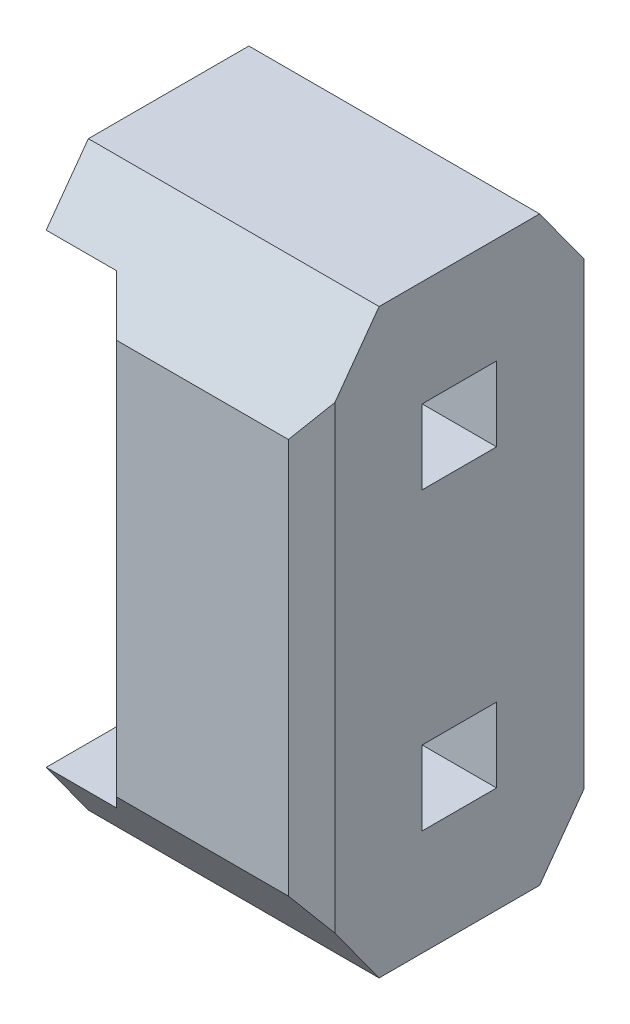
ISO-10303-21;
HEADER;
FILE_DESCRIPTION(('STEP AP214'),'2;1');
FILE_NAME('part.step','',(''),(''),'','','');
FILE_SCHEMA(('AUTOMOTIVE_DESIGN { 1 0 10303 214 1 1 1 1 }'));
ENDSEC;
DATA;
#1=APPLICATION_CONTEXT('core data for automotive mechanical design processes');
#2=APPLICATION_PROTOCOL_DEFINITION('international standard','automotive_design',2000,#1);
#3=PRODUCT_CONTEXT('',#1,'mechanical');
#4=PRODUCT('Part','Part','',(#3));
#5=PRODUCT_RELATED_PRODUCT_CATEGORY('part','',(#4));
#6=PRODUCT_DEFINITION_FORMATION('','',#4);
#7=PRODUCT_DEFINITION_CONTEXT('part definition',#1,'design');
#8=PRODUCT_DEFINITION('design','',#6,#7);
#9=PRODUCT_DEFINITION_SHAPE('','',#8);
#10=(LENGTH_UNIT() NAMED_UNIT(*) SI_UNIT(.MILLI.,.METRE.));
#11=(NAMED_UNIT(*) PLANE_ANGLE_UNIT() SI_UNIT($,.RADIAN.));
#12=(NAMED_UNIT(*) SI_UNIT($,.STERADIAN.) SOLID_ANGLE_UNIT());
#13=UNCERTAINTY_MEASURE_WITH_UNIT(LENGTH_MEASURE(1.E-05),#10,'distance_accuracy_value','');
#14=(GEOMETRIC_REPRESENTATION_CONTEXT(3) GLOBAL_UNCERTAINTY_ASSIGNED_CONTEXT((#13)) GLOBAL_UNIT_ASSIGNED_CONTEXT((#10,
#11,#12)) REPRESENTATION_CONTEXT('',''));
#15=CARTESIAN_POINT('',(0.,0.,0.));
#16=DIRECTION('',(0.,0.,1.));
#17=DIRECTION('',(1.,0.,0.));
#18=AXIS2_PLACEMENT_3D('',#15,#16,#17);
#19=CARTESIAN_POINT('',(1.25,4.6,-38.39));
#20=DIRECTION('',(0.,0.586967571460905,0.809610443394407));
#21=DIRECTION('',(0.,-0.809610443394407,0.586967571460905));
#22=AXIS2_PLACEMENT_3D('',#19,#20,#21);
#23=PLANE('',#22);
#24=DIRECTION('',(1.,0.,0.));
#25=VECTOR('',#24,1.);
#26=CARTESIAN_POINT('',(1.25,4.5,-38.3175));
#27=LINE('',#26,#25);
#28=CARTESIAN_POINT('',(0.,4.5,-38.3175));
#29=VERTEX_POINT('',#28);
#30=CARTESIAN_POINT('',(0.602500000000325,4.5,-38.3175000000001));
#31=VERTEX_POINT('',#30);
#32=EDGE_CURVE('E199',#29,#31,#27,.T.);
#33=ORIENTED_EDGE('',*,*,#32,.T.);
#34=DIRECTION('',(0.506207656348697,-0.698217457033984,0.506207656349602));
#35=VECTOR('',#34,1.);
#36=CARTESIAN_POINT('',(0.6025000000002,4.5,-38.3175));
#37=LINE('',#36,#35);
#38=CARTESIAN_POINT('',(0.819999999999671,4.2,-38.0999999999999));
#39=VERTEX_POINT('',#38);
#40=EDGE_CURVE('E197',#31,#39,#37,.T.);
#41=ORIENTED_EDGE('',*,*,#40,.T.);
#42=DIRECTION('',(1.,0.,0.));
#43=VECTOR('',#42,1.);
#44=CARTESIAN_POINT('',(1.25,4.19999999999999,-38.1));
#45=LINE('',#44,#43);
#46=CARTESIAN_POINT('',(2.30000000000012,4.2,-38.0999999999999));
#47=VERTEX_POINT('',#46);
#48=EDGE_CURVE('E20',#39,#47,#45,.T.);
#49=ORIENTED_EDGE('',*,*,#48,.T.);
#50=DIRECTION('',(0.506207656348957,0.698217457033858,-0.506207656349515));
#51=VECTOR('',#50,1.);
#52=CARTESIAN_POINT('',(2.3,4.19999999999999,-38.1));
#53=LINE('',#52,#51);
#54=CARTESIAN_POINT('',(2.49999999999988,4.47586206896592,-38.3000000000002));
#55=VERTEX_POINT('',#54);
#56=EDGE_CURVE('E181',#47,#55,#53,.T.);
#57=ORIENTED_EDGE('',*,*,#56,.T.);
#58=DIRECTION('',(0.,-0.809610443394407,0.586967571460905));
#59=VECTOR('',#58,1.);
#60=CARTESIAN_POINT('',(2.5,4.6,-38.39));
#61=LINE('',#60,#59);
#62=CARTESIAN_POINT('',(2.5,5.,-38.68));
#63=VERTEX_POINT('',#62);
#64=EDGE_CURVE('E188',#55,#63,#61,.F.);
#65=ORIENTED_EDGE('',*,*,#64,.T.);
#66=DIRECTION('',(1.,0.,0.));
#67=VECTOR('',#66,1.);
#68=CARTESIAN_POINT('',(1.25,5.,-38.68));
#69=LINE('',#68,#67);
#70=CARTESIAN_POINT('',(0.,5.,-38.68));
#71=VERTEX_POINT('',#70);
#72=EDGE_CURVE('E215',#71,#63,#69,.T.);
#73=ORIENTED_EDGE('',*,*,#72,.F.);
#74=DIRECTION('',(0.,-0.809610443394407,0.586967571460905));
#75=VECTOR('',#74,1.);
#76=CARTESIAN_POINT('',(0.,4.6,-38.39));
#77=LINE('',#76,#75);
#78=EDGE_CURVE('E207',#71,#29,#77,.T.);
#79=ORIENTED_EDGE('',*,*,#78,.T.);
#80=EDGE_LOOP('',(#33,#41,#49,#57,#65,#73,#79));
#81=FACE_BOUND('',#80,.T.);
#82=ADVANCED_FACE('F17',(#81),#23,.T.);
#83=CARTESIAN_POINT('',(1.25,4.6,-40.35));
#84=DIRECTION('',(0.,-0.586967571460905,0.809610443394407));
#85=DIRECTION('',(0.,-0.809610443394407,-0.586967571460905));
#86=AXIS2_PLACEMENT_3D('',#83,#84,#85);
#87=PLANE('',#86);
#88=DIRECTION('',(0.,-0.809610443394407,-0.586967571460905));
#89=VECTOR('',#88,1.);
#90=CARTESIAN_POINT('',(0.,4.6,-40.35));
#91=LINE('',#90,#89);
#92=CARTESIAN_POINT('',(0.,5.,-40.06));
#93=VERTEX_POINT('',#92);
#94=CARTESIAN_POINT('',(0.,4.5,-40.4225));
#95=VERTEX_POINT('',#94);
#96=EDGE_CURVE('E263',#93,#95,#91,.T.);
#97=ORIENTED_EDGE('',*,*,#96,.F.);
#98=DIRECTION('',(1.,0.,0.));
#99=VECTOR('',#98,1.);
#100=CARTESIAN_POINT('',(1.25,5.,-40.06));
#101=LINE('',#100,#99);
#102=CARTESIAN_POINT('',(2.5,5.,-40.06));
#103=VERTEX_POINT('',#102);
#104=EDGE_CURVE('E227',#103,#93,#101,.F.);
#105=ORIENTED_EDGE('',*,*,#104,.F.);
#106=DIRECTION('',(0.,-0.809610443394407,-0.586967571460905));
#107=VECTOR('',#106,1.);
#108=CARTESIAN_POINT('',(2.5,4.6,-40.35));
#109=LINE('',#108,#107);
#110=CARTESIAN_POINT('',(2.49999999999988,4.47586206896592,-40.4399999999998));
#111=VERTEX_POINT('',#110);
#112=EDGE_CURVE('E223',#111,#103,#109,.F.);
#113=ORIENTED_EDGE('',*,*,#112,.F.);
#114=DIRECTION('',(0.506207656348954,0.698217457033861,0.506207656349513));
#115=VECTOR('',#114,1.);
#116=CARTESIAN_POINT('',(2.3,4.19999999999999,-40.64));
#117=LINE('',#116,#115);
#118=CARTESIAN_POINT('',(2.30000000000012,4.2,-40.6400000000001));
#119=VERTEX_POINT('',#118);
#120=EDGE_CURVE('E266',#119,#111,#117,.T.);
#121=ORIENTED_EDGE('',*,*,#120,.F.);
#122=DIRECTION('',(1.,0.,0.));
#123=VECTOR('',#122,1.);
#124=CARTESIAN_POINT('',(1.25,4.19999999999999,-40.64));
#125=LINE('',#124,#123);
#126=CARTESIAN_POINT('',(0.819999999999671,4.2,-40.6400000000001));
#127=VERTEX_POINT('',#126);
#128=EDGE_CURVE('E205',#127,#119,#125,.T.);
#129=ORIENTED_EDGE('',*,*,#128,.F.);
#130=DIRECTION('',(0.506207656348697,-0.698217457033984,-0.506207656349602));
#131=VECTOR('',#130,1.);
#132=CARTESIAN_POINT('',(0.6025000000002,4.5,-40.4225));
#133=LINE('',#132,#131);
#134=CARTESIAN_POINT('',(0.602500000000324,4.5,-40.4224999999999));
#135=VERTEX_POINT('',#134);
#136=EDGE_CURVE('E203',#135,#127,#133,.T.);
#137=ORIENTED_EDGE('',*,*,#136,.F.);
#138=DIRECTION('',(1.,0.,0.));
#139=VECTOR('',#138,1.);
#140=CARTESIAN_POINT('',(1.25,4.5,-40.4225));
#141=LINE('',#140,#139);
#142=EDGE_CURVE('E261',#95,#135,#141,.T.);
#143=ORIENTED_EDGE('',*,*,#142,.F.);
#144=EDGE_LOOP('',(#97,#105,#113,#121,#129,#137,#143));
#145=FACE_BOUND('',#144,.T.);
#146=ADVANCED_FACE('F285',(#145),#87,.F.);
#147=CARTESIAN_POINT('',(1.25,0.4,-40.35));
#148=DIRECTION('',(0.,0.586967571460905,0.809610443394407));
#149=DIRECTION('',(0.,-0.809610443394407,0.586967571460905));
#150=AXIS2_PLACEMENT_3D('',#147,#148,#149);
#151=PLANE('',#150);
#152=DIRECTION('',(-0.5062076563494,0.698217457033649,-0.506207656349361));
#153=VECTOR('',#152,1.);
#154=CARTESIAN_POINT('',(2.5,0.524137931034493,-40.44));
#155=LINE('',#154,#153);
#156=CARTESIAN_POINT('',(2.49999999999988,0.524137931034496,-40.4399999999999));
#157=VERTEX_POINT('',#156);
#158=CARTESIAN_POINT('',(2.30000000000012,0.800000000000004,-40.6400000000001));
#159=VERTEX_POINT('',#158);
#160=EDGE_CURVE('E251',#157,#159,#155,.T.);
#161=ORIENTED_EDGE('',*,*,#160,.F.);
#162=DIRECTION('',(0.,-0.809610443394407,0.586967571460905));
#163=VECTOR('',#162,1.);
#164=CARTESIAN_POINT('',(2.5,0.4,-40.35));
#165=LINE('',#164,#163);
#166=CARTESIAN_POINT('',(2.5,0.,-40.06));
#167=VERTEX_POINT('',#166);
#168=EDGE_CURVE('E253',#167,#157,#165,.F.);
#169=ORIENTED_EDGE('',*,*,#168,.F.);
#170=DIRECTION('',(1.,0.,0.));
#171=VECTOR('',#170,1.);
#172=CARTESIAN_POINT('',(1.25,0.,-40.06));
#173=LINE('',#172,#171);
#174=CARTESIAN_POINT('',(0.,0.,-40.06));
#175=VERTEX_POINT('',#174);
#176=EDGE_CURVE('E288',#167,#175,#173,.F.);
#177=ORIENTED_EDGE('',*,*,#176,.T.);
#178=DIRECTION('',(0.,-0.809610443394407,0.586967571460905));
#179=VECTOR('',#178,1.);
#180=CARTESIAN_POINT('',(0.,0.4,-40.35));
#181=LINE('',#180,#179);
#182=CARTESIAN_POINT('',(0.,0.5,-40.4225));
#183=VERTEX_POINT('',#182);
#184=EDGE_CURVE('E255',#183,#175,#181,.T.);
#185=ORIENTED_EDGE('',*,*,#184,.F.);
#186=DIRECTION('',(1.,0.,0.));
#187=VECTOR('',#186,1.);
#188=CARTESIAN_POINT('',(1.25,0.500000000000001,-40.4225));
#189=LINE('',#188,#187);
#190=CARTESIAN_POINT('',(0.602500000000324,0.5,-40.4224999999999));
#191=VERTEX_POINT('',#190);
#192=EDGE_CURVE('E257',#191,#183,#189,.F.);
#193=ORIENTED_EDGE('',*,*,#192,.F.);
#194=DIRECTION('',(-0.506207656348696,-0.698217457033985,0.506207656349601));
#195=VECTOR('',#194,1.);
#196=CARTESIAN_POINT('',(0.8199999999998,0.800000000000008,-40.64));
#197=LINE('',#196,#195);
#198=CARTESIAN_POINT('',(0.819999999999671,0.800000000000004,-40.6400000000001));
#199=VERTEX_POINT('',#198);
#200=EDGE_CURVE('E259',#199,#191,#197,.T.);
#201=ORIENTED_EDGE('',*,*,#200,.F.);
#202=DIRECTION('',(1.,0.,0.));
#203=VECTOR('',#202,1.);
#204=CARTESIAN_POINT('',(1.25,0.800000000000008,-40.64));
#205=LINE('',#204,#203);
#206=EDGE_CURVE('E249',#159,#199,#205,.F.);
#207=ORIENTED_EDGE('',*,*,#206,.F.);
#208=EDGE_LOOP('',(#161,#169,#177,#185,#193,#201,#207));
#209=FACE_BOUND('',#208,.T.);
#210=ADVANCED_FACE('F431',(#209),#151,.F.);
#211=CARTESIAN_POINT('',(1.25,0.4,-38.39));
#212=DIRECTION('',(0.,-0.586967571460905,0.809610443394407));
#213=DIRECTION('',(0.,-0.809610443394407,-0.586967571460905));
#214=AXIS2_PLACEMENT_3D('',#211,#212,#213);
#215=PLANE('',#214);
#216=DIRECTION('',(1.,0.,0.));
#217=VECTOR('',#216,1.);
#218=CARTESIAN_POINT('',(1.25,0.800000000000008,-38.1));
#219=LINE('',#218,#217);
#220=CARTESIAN_POINT('',(2.30000000000012,0.800000000000004,-38.0999999999999));
#221=VERTEX_POINT('',#220);
#222=CARTESIAN_POINT('',(0.819999999999671,0.800000000000004,-38.0999999999999));
#223=VERTEX_POINT('',#222);
#224=EDGE_CURVE('E191',#221,#223,#219,.F.);
#225=ORIENTED_EDGE('',*,*,#224,.T.);
#226=DIRECTION('',(-0.506207656348696,-0.698217457033985,-0.506207656349601));
#227=VECTOR('',#226,1.);
#228=CARTESIAN_POINT('',(0.8199999999998,0.800000000000008,-38.1));
#229=LINE('',#228,#227);
#230=CARTESIAN_POINT('',(0.602500000000324,0.5,-38.3175000000001));
#231=VERTEX_POINT('',#230);
#232=EDGE_CURVE('E232',#223,#231,#229,.T.);
#233=ORIENTED_EDGE('',*,*,#232,.T.);
#234=DIRECTION('',(1.,0.,0.));
#235=VECTOR('',#234,1.);
#236=CARTESIAN_POINT('',(1.25,0.500000000000001,-38.3175));
#237=LINE('',#236,#235);
#238=CARTESIAN_POINT('',(0.,0.5,-38.3175));
#239=VERTEX_POINT('',#238);
#240=EDGE_CURVE('E246',#231,#239,#237,.F.);
#241=ORIENTED_EDGE('',*,*,#240,.T.);
#242=DIRECTION('',(0.,-0.809610443394407,-0.586967571460905));
#243=VECTOR('',#242,1.);
#244=CARTESIAN_POINT('',(0.,0.4,-38.39));
#245=LINE('',#244,#243);
#246=CARTESIAN_POINT('',(0.,0.,-38.68));
#247=VERTEX_POINT('',#246);
#248=EDGE_CURVE('E244',#239,#247,#245,.T.);
#249=ORIENTED_EDGE('',*,*,#248,.T.);
#250=DIRECTION('',(1.,0.,0.));
#251=VECTOR('',#250,1.);
#252=CARTESIAN_POINT('',(1.25,0.,-38.68));
#253=LINE('',#252,#251);
#254=CARTESIAN_POINT('',(2.5,0.,-38.68));
#255=VERTEX_POINT('',#254);
#256=EDGE_CURVE('E293',#247,#255,#253,.T.);
#257=ORIENTED_EDGE('',*,*,#256,.T.);
#258=DIRECTION('',(0.,-0.809610443394407,-0.586967571460905));
#259=VECTOR('',#258,1.);
#260=CARTESIAN_POINT('',(2.5,0.4,-38.39));
#261=LINE('',#260,#259);
#262=CARTESIAN_POINT('',(2.49999999999988,0.524137931034499,-38.3000000000001));
#263=VERTEX_POINT('',#262);
#264=EDGE_CURVE('E241',#255,#263,#261,.F.);
#265=ORIENTED_EDGE('',*,*,#264,.T.);
#266=DIRECTION('',(-0.506207656349409,0.698217457033648,0.506207656349353));
#267=VECTOR('',#266,1.);
#268=CARTESIAN_POINT('',(2.5,0.524137931034498,-38.3));
#269=LINE('',#268,#267);
#270=EDGE_CURVE('E239',#263,#221,#269,.T.);
#271=ORIENTED_EDGE('',*,*,#270,.T.);
#272=EDGE_LOOP('',(#225,#233,#241,#249,#257,#265,#271));
#273=FACE_BOUND('',#272,.T.);
#274=ADVANCED_FACE('F421',(#273),#215,.T.);
#275=CARTESIAN_POINT('',(1.25,5.,-39.37));
#276=DIRECTION('',(0.,1.,0.));
#277=DIRECTION('',(0.,0.,1.));
#278=AXIS2_PLACEMENT_3D('',#275,#276,#277);
#279=PLANE('',#278);
#280=ORIENTED_EDGE('',*,*,#104,.T.);
#281=DIRECTION('',(0.,0.,-1.));
#282=VECTOR('',#281,1.);
#283=CARTESIAN_POINT('',(0.,5.,-39.37));
#284=LINE('',#283,#282);
#285=EDGE_CURVE('E231',#93,#71,#284,.F.);
#286=ORIENTED_EDGE('',*,*,#285,.T.);
#287=ORIENTED_EDGE('',*,*,#72,.T.);
#288=DIRECTION('',(0.,0.,1.));
#289=VECTOR('',#288,1.);
#290=CARTESIAN_POINT('',(2.5,5.,-39.37));
#291=LINE('',#290,#289);
#292=EDGE_CURVE('E219',#63,#103,#291,.F.);
#293=ORIENTED_EDGE('',*,*,#292,.T.);
#294=EDGE_LOOP('',(#280,#286,#287,#293));
#295=FACE_BOUND('',#294,.T.);
#296=ADVANCED_FACE('F229',(#295),#279,.T.);
#297=CARTESIAN_POINT('',(1.25,0.,-39.37));
#298=DIRECTION('',(0.,1.,0.));
#299=DIRECTION('',(0.,0.,1.));
#300=AXIS2_PLACEMENT_3D('',#297,#298,#299);
#301=PLANE('',#300);
#302=DIRECTION('',(0.,0.,-1.));
#303=VECTOR('',#302,1.);
#304=CARTESIAN_POINT('',(0.,0.,-39.37));
#305=LINE('',#304,#303);
#306=EDGE_CURVE('E297',#247,#175,#305,.T.);
#307=ORIENTED_EDGE('',*,*,#306,.T.);
#308=ORIENTED_EDGE('',*,*,#176,.F.);
#309=DIRECTION('',(0.,0.,1.));
#310=VECTOR('',#309,1.);
#311=CARTESIAN_POINT('',(2.5,0.,-39.37));
#312=LINE('',#311,#310);
#313=EDGE_CURVE('E287',#255,#167,#312,.F.);
#314=ORIENTED_EDGE('',*,*,#313,.F.);
#315=ORIENTED_EDGE('',*,*,#256,.F.);
#316=EDGE_LOOP('',(#307,#308,#314,#315));
#317=FACE_BOUND('',#316,.T.);
#318=ADVANCED_FACE('F428',(#317),#301,.F.);
#319=CARTESIAN_POINT('',(0.,4.75,-39.37));
#320=DIRECTION('',(1.,0.,0.));
#321=DIRECTION('',(0.,0.,-1.));
#322=AXIS2_PLACEMENT_3D('',#319,#320,#321);
#323=PLANE('',#322);
#324=ORIENTED_EDGE('',*,*,#285,.F.);
#325=ORIENTED_EDGE('',*,*,#96,.T.);
#326=DIRECTION('',(0.,0.,1.));
#327=VECTOR('',#326,1.);
#328=CARTESIAN_POINT('',(0.,4.5,-39.37));
#329=LINE('',#328,#327);
#330=EDGE_CURVE('E307',#95,#29,#329,.T.);
#331=ORIENTED_EDGE('',*,*,#330,.T.);
#332=ORIENTED_EDGE('',*,*,#78,.F.);
#333=EDGE_LOOP('',(#324,#325,#331,#332));
#334=FACE_BOUND('',#333,.T.);
#335=ADVANCED_FACE('F441',(#334),#323,.F.);
#336=CARTESIAN_POINT('',(0.,0.25,-39.37));
#337=DIRECTION('',(1.,0.,0.));
#338=DIRECTION('',(0.,0.,-1.));
#339=AXIS2_PLACEMENT_3D('',#336,#337,#338);
#340=PLANE('',#339);
#341=ORIENTED_EDGE('',*,*,#306,.F.);
#342=ORIENTED_EDGE('',*,*,#248,.F.);
#343=DIRECTION('',(0.,0.,1.));
#344=VECTOR('',#343,1.);
#345=CARTESIAN_POINT('',(0.,0.5,-39.37));
#346=LINE('',#345,#344);
#347=EDGE_CURVE('E315',#183,#239,#346,.T.);
#348=ORIENTED_EDGE('',*,*,#347,.F.);
#349=ORIENTED_EDGE('',*,*,#184,.T.);
#350=EDGE_LOOP('',(#341,#342,#348,#349));
#351=FACE_BOUND('',#350,.T.);
#352=ADVANCED_FACE('F443',(#351),#340,.F.);
#353=CARTESIAN_POINT('',(1.55,3.45,-39.37));
#354=DIRECTION('',(0.,1.,0.));
#355=DIRECTION('',(0.,0.,1.));
#356=AXIS2_PLACEMENT_3D('',#353,#354,#355);
#357=PLANE('',#356);
#358=DIRECTION('',(1.,0.,0.));
#359=VECTOR('',#358,1.);
#360=CARTESIAN_POINT('',(1.55,3.45,-39.69));
#361=LINE('',#360,#359);
#362=CARTESIAN_POINT('',(0.6,3.45,-39.69));
#363=VERTEX_POINT('',#362);
#364=CARTESIAN_POINT('',(2.5,3.45,-39.69));
#365=VERTEX_POINT('',#364);
#366=EDGE_CURVE('E332',#363,#365,#361,.T.);
#367=ORIENTED_EDGE('',*,*,#366,.F.);
#368=DIRECTION('',(0.,0.,1.));
#369=VECTOR('',#368,1.);
#370=CARTESIAN_POINT('',(0.6,3.45,-39.37));
#371=LINE('',#370,#369);
#372=CARTESIAN_POINT('',(0.6,3.45,-39.05));
#373=VERTEX_POINT('',#372);
#374=EDGE_CURVE('E302',#363,#373,#371,.T.);
#375=ORIENTED_EDGE('',*,*,#374,.T.);
#376=DIRECTION('',(1.,0.,0.));
#377=VECTOR('',#376,1.);
#378=CARTESIAN_POINT('',(1.55,3.45,-39.05));
#379=LINE('',#378,#377);
#380=CARTESIAN_POINT('',(2.5,3.45,-39.05));
#381=VERTEX_POINT('',#380);
#382=EDGE_CURVE('E327',#373,#381,#379,.T.);
#383=ORIENTED_EDGE('',*,*,#382,.T.);
#384=DIRECTION('',(0.,0.,1.));
#385=VECTOR('',#384,1.);
#386=CARTESIAN_POINT('',(2.5,3.45,-39.37));
#387=LINE('',#386,#385);
#388=EDGE_CURVE('E300',#381,#365,#387,.F.);
#389=ORIENTED_EDGE('',*,*,#388,.T.);
#390=EDGE_LOOP('',(#367,#375,#383,#389));
#391=FACE_BOUND('',#390,.T.);
#392=ADVANCED_FACE('F398',(#391),#357,.T.);
#393=CARTESIAN_POINT('',(0.71,2.5,-40.53));
#394=DIRECTION('',(0.707106781190498,0.,0.707106781182598));
#395=DIRECTION('',(0.707106781182598,0.,-0.707106781190498));
#396=AXIS2_PLACEMENT_3D('',#393,#394,#395);
#397=PLANE('',#396);
#398=ORIENTED_EDGE('',*,*,#200,.T.);
#399=DIRECTION('',(0.707106781187161,0.,-0.707106781185934));
#400=VECTOR('',#399,1.);
#401=CARTESIAN_POINT('',(0.6000000000002,0.5,-40.42));
#402=LINE('',#401,#400);
#403=CARTESIAN_POINT('',(0.600000000000408,0.5,-40.4199999999997));
#404=VERTEX_POINT('',#403);
#405=EDGE_CURVE('E312',#404,#191,#402,.T.);
#406=ORIENTED_EDGE('',*,*,#405,.F.);
#407=DIRECTION('',(0.,1.,0.));
#408=VECTOR('',#407,1.);
#409=CARTESIAN_POINT('',(0.6,2.5,-40.42));
#410=LINE('',#409,#408);
#411=CARTESIAN_POINT('',(0.600000000000408,4.5,-40.4199999999997));
#412=VERTEX_POINT('',#411);
#413=EDGE_CURVE('E337',#404,#412,#410,.T.);
#414=ORIENTED_EDGE('',*,*,#413,.T.);
#415=DIRECTION('',(0.707106781187161,0.,-0.707106781185934));
#416=VECTOR('',#415,1.);
#417=CARTESIAN_POINT('',(0.6000000000002,4.5,-40.42));
#418=LINE('',#417,#416);
#419=EDGE_CURVE('E304',#412,#135,#418,.T.);
#420=ORIENTED_EDGE('',*,*,#419,.T.);
#421=ORIENTED_EDGE('',*,*,#136,.T.);
#422=DIRECTION('',(0.,1.,0.));
#423=VECTOR('',#422,1.);
#424=CARTESIAN_POINT('',(0.8199999999998,2.5,-40.64));
#425=LINE('',#424,#423);
#426=EDGE_CURVE('E275',#127,#199,#425,.F.);
#427=ORIENTED_EDGE('',*,*,#426,.T.);
#428=EDGE_LOOP('',(#398,#406,#414,#420,#421,#427));
#429=FACE_BOUND('',#428,.T.);
#430=ADVANCED_FACE('F435',(#429),#397,.F.);
#431=CARTESIAN_POINT('',(0.30125,4.5,-39.37));
#432=DIRECTION('',(0.,1.,0.));
#433=DIRECTION('',(0.,0.,1.));
#434=AXIS2_PLACEMENT_3D('',#431,#432,#433);
#435=PLANE('',#434);
#436=ORIENTED_EDGE('',*,*,#142,.T.);
#437=ORIENTED_EDGE('',*,*,#419,.F.);
#438=DIRECTION('',(0.,0.,-1.));
#439=VECTOR('',#438,1.);
#440=CARTESIAN_POINT('',(0.6,4.5,-39.37));
#441=LINE('',#440,#439);
#442=CARTESIAN_POINT('',(0.600000000000279,4.5,-38.3200000000001));
#443=VERTEX_POINT('',#442);
#444=EDGE_CURVE('E339',#412,#443,#441,.F.);
#445=ORIENTED_EDGE('',*,*,#444,.T.);
#446=DIRECTION('',(-0.707106781182598,0.,-0.707106781190498));
#447=VECTOR('',#446,1.);
#448=CARTESIAN_POINT('',(0.71,4.5,-38.21));
#449=LINE('',#448,#447);
#450=EDGE_CURVE('E310',#443,#31,#449,.F.);
#451=ORIENTED_EDGE('',*,*,#450,.T.);
#452=ORIENTED_EDGE('',*,*,#32,.F.);
#453=ORIENTED_EDGE('',*,*,#330,.F.);
#454=EDGE_LOOP('',(#436,#437,#445,#451,#452,#453));
#455=FACE_BOUND('',#454,.T.);
#456=ADVANCED_FACE('F439',(#455),#435,.F.);
#457=CARTESIAN_POINT('',(0.71,2.5,-38.21));
#458=DIRECTION('',(0.707106781190498,0.,-0.707106781182598));
#459=DIRECTION('',(-0.707106781182598,0.,-0.707106781190498));
#460=AXIS2_PLACEMENT_3D('',#457,#458,#459);
#461=PLANE('',#460);
#462=ORIENTED_EDGE('',*,*,#232,.F.);
#463=DIRECTION('',(0.,1.,0.));
#464=VECTOR('',#463,1.);
#465=CARTESIAN_POINT('',(0.8199999999998,2.5,-38.1));
#466=LINE('',#465,#464);
#467=EDGE_CURVE('E325',#39,#223,#466,.F.);
#468=ORIENTED_EDGE('',*,*,#467,.F.);
#469=ORIENTED_EDGE('',*,*,#40,.F.);
#470=ORIENTED_EDGE('',*,*,#450,.F.);
#471=DIRECTION('',(0.,1.,0.));
#472=VECTOR('',#471,1.);
#473=CARTESIAN_POINT('',(0.6,2.5,-38.32));
#474=LINE('',#473,#472);
#475=CARTESIAN_POINT('',(0.600000000000408,0.5,-38.3200000000003));
#476=VERTEX_POINT('',#475);
#477=EDGE_CURVE('E341',#443,#476,#474,.F.);
#478=ORIENTED_EDGE('',*,*,#477,.T.);
#479=DIRECTION('',(-0.707106781187161,0.,-0.707106781185934));
#480=VECTOR('',#479,1.);
#481=CARTESIAN_POINT('',(0.6025000000002,0.5,-38.3175));
#482=LINE('',#481,#480);
#483=EDGE_CURVE('E318',#231,#476,#482,.T.);
#484=ORIENTED_EDGE('',*,*,#483,.F.);
#485=EDGE_LOOP('',(#462,#468,#469,#470,#478,#484));
#486=FACE_BOUND('',#485,.T.);
#487=ADVANCED_FACE('F416',(#486),#461,.F.);
#488=CARTESIAN_POINT('',(0.30125,0.5,-39.37));
#489=DIRECTION('',(0.,1.,0.));
#490=DIRECTION('',(0.,0.,1.));
#491=AXIS2_PLACEMENT_3D('',#488,#489,#490);
#492=PLANE('',#491);
#493=ORIENTED_EDGE('',*,*,#483,.T.);
#494=DIRECTION('',(0.,0.,-1.));
#495=VECTOR('',#494,1.);
#496=CARTESIAN_POINT('',(0.6,0.5,-39.37));
#497=LINE('',#496,#495);
#498=EDGE_CURVE('E343',#476,#404,#497,.T.);
#499=ORIENTED_EDGE('',*,*,#498,.T.);
#500=ORIENTED_EDGE('',*,*,#405,.T.);
#501=ORIENTED_EDGE('',*,*,#192,.T.);
#502=ORIENTED_EDGE('',*,*,#347,.T.);
#503=ORIENTED_EDGE('',*,*,#240,.F.);
#504=EDGE_LOOP('',(#493,#499,#500,#501,#502,#503));
#505=FACE_BOUND('',#504,.T.);
#506=ADVANCED_FACE('F418',(#505),#492,.T.);
#507=CARTESIAN_POINT('',(1.55,1.23,-39.69));
#508=DIRECTION('',(0.,0.,1.));
#509=DIRECTION('',(1.,0.,0.));
#510=AXIS2_PLACEMENT_3D('',#507,#508,#509);
#511=PLANE('',#510);
#512=DIRECTION('',(1.,0.,0.));
#513=VECTOR('',#512,1.);
#514=CARTESIAN_POINT('',(1.55,1.55,-39.69));
#515=LINE('',#514,#513);
#516=CARTESIAN_POINT('',(2.5,1.55,-39.69));
#517=VERTEX_POINT('',#516);
#518=CARTESIAN_POINT('',(0.6,1.55,-39.69));
#519=VERTEX_POINT('',#518);
#520=EDGE_CURVE('E283',#517,#519,#515,.F.);
#521=ORIENTED_EDGE('',*,*,#520,.T.);
#522=DIRECTION('',(0.,1.,0.));
#523=VECTOR('',#522,1.);
#524=CARTESIAN_POINT('',(0.6,2.5,-39.69));
#525=LINE('',#524,#523);
#526=CARTESIAN_POINT('',(0.6,0.91,-39.69));
#527=VERTEX_POINT('',#526);
#528=EDGE_CURVE('E346',#519,#527,#525,.F.);
#529=ORIENTED_EDGE('',*,*,#528,.T.);
#530=DIRECTION('',(1.,0.,0.));
#531=VECTOR('',#530,1.);
#532=CARTESIAN_POINT('',(1.55,0.91,-39.69));
#533=LINE('',#532,#531);
#534=CARTESIAN_POINT('',(2.5,0.91,-39.69));
#535=VERTEX_POINT('',#534);
#536=EDGE_CURVE('E354',#535,#527,#533,.F.);
#537=ORIENTED_EDGE('',*,*,#536,.F.);
#538=DIRECTION('',(0.,1.,0.));
#539=VECTOR('',#538,1.);
#540=CARTESIAN_POINT('',(2.5,1.23,-39.69));
#541=LINE('',#540,#539);
#542=EDGE_CURVE('E321',#535,#517,#541,.T.);
#543=ORIENTED_EDGE('',*,*,#542,.T.);
#544=EDGE_LOOP('',(#521,#529,#537,#543));
#545=FACE_BOUND('',#544,.T.);
#546=ADVANCED_FACE('F483',(#545),#511,.T.);
#547=CARTESIAN_POINT('',(1.56,2.5,-40.64));
#548=DIRECTION('',(0.,0.,1.));
#549=DIRECTION('',(1.,0.,0.));
#550=AXIS2_PLACEMENT_3D('',#547,#548,#549);
#551=PLANE('',#550);
#552=DIRECTION('',(0.,1.,0.));
#553=VECTOR('',#552,1.);
#554=CARTESIAN_POINT('',(2.30000000000047,2.5,-40.6400000000005));
#555=LINE('',#554,#553);
#556=EDGE_CURVE('E193',#159,#119,#555,.T.);
#557=ORIENTED_EDGE('',*,*,#556,.F.);
#558=ORIENTED_EDGE('',*,*,#206,.T.);
#559=ORIENTED_EDGE('',*,*,#426,.F.);
#560=ORIENTED_EDGE('',*,*,#128,.T.);
#561=EDGE_LOOP('',(#557,#558,#559,#560));
#562=FACE_BOUND('',#561,.T.);
#563=ADVANCED_FACE('F272',(#562),#551,.F.);
#564=CARTESIAN_POINT('',(1.56,2.5,-38.1));
#565=DIRECTION('',(0.,0.,1.));
#566=DIRECTION('',(1.,0.,0.));
#567=AXIS2_PLACEMENT_3D('',#564,#565,#566);
#568=PLANE('',#567);
#569=ORIENTED_EDGE('',*,*,#48,.F.);
#570=ORIENTED_EDGE('',*,*,#467,.T.);
#571=ORIENTED_EDGE('',*,*,#224,.F.);
#572=DIRECTION('',(0.,1.,0.));
#573=VECTOR('',#572,1.);
#574=CARTESIAN_POINT('',(2.30000000000047,2.5,-38.0999999999995));
#575=LINE('',#574,#573);
#576=EDGE_CURVE('E183',#47,#221,#575,.F.);
#577=ORIENTED_EDGE('',*,*,#576,.F.);
#578=EDGE_LOOP('',(#569,#570,#571,#577));
#579=FACE_BOUND('',#578,.T.);
#580=ADVANCED_FACE('F189',(#579),#568,.T.);
#581=CARTESIAN_POINT('',(1.55,3.77,-39.05));
#582=DIRECTION('',(0.,0.,1.));
#583=DIRECTION('',(1.,0.,0.));
#584=AXIS2_PLACEMENT_3D('',#581,#582,#583);
#585=PLANE('',#584);
#586=DIRECTION('',(0.,1.,0.));
#587=VECTOR('',#586,1.);
#588=CARTESIAN_POINT('',(2.5,3.77,-39.05));
#589=LINE('',#588,#587);
#590=CARTESIAN_POINT('',(2.5,4.09,-39.05));
#591=VERTEX_POINT('',#590);
#592=EDGE_CURVE('E330',#381,#591,#589,.T.);
#593=ORIENTED_EDGE('',*,*,#592,.F.);
#594=ORIENTED_EDGE('',*,*,#382,.F.);
#595=DIRECTION('',(0.,1.,0.));
#596=VECTOR('',#595,1.);
#597=CARTESIAN_POINT('',(0.6,2.5,-39.05));
#598=LINE('',#597,#596);
#599=CARTESIAN_POINT('',(0.6,4.09,-39.05));
#600=VERTEX_POINT('',#599);
#601=EDGE_CURVE('E351',#373,#600,#598,.T.);
#602=ORIENTED_EDGE('',*,*,#601,.T.);
#603=DIRECTION('',(1.,0.,0.));
#604=VECTOR('',#603,1.);
#605=CARTESIAN_POINT('',(1.55,4.09,-39.05));
#606=LINE('',#605,#604);
#607=EDGE_CURVE('E368',#600,#591,#606,.T.);
#608=ORIENTED_EDGE('',*,*,#607,.T.);
#609=EDGE_LOOP('',(#593,#594,#602,#608));
#610=FACE_BOUND('',#609,.T.);
#611=ADVANCED_FACE('F402',(#610),#585,.F.);
#612=CARTESIAN_POINT('',(1.55,3.77,-39.69));
#613=DIRECTION('',(0.,0.,1.));
#614=DIRECTION('',(1.,0.,0.));
#615=AXIS2_PLACEMENT_3D('',#612,#613,#614);
#616=PLANE('',#615);
#617=DIRECTION('',(1.,0.,0.));
#618=VECTOR('',#617,1.);
#619=CARTESIAN_POINT('',(1.55,4.09,-39.69));
#620=LINE('',#619,#618);
#621=CARTESIAN_POINT('',(2.5,4.09,-39.69));
#622=VERTEX_POINT('',#621);
#623=CARTESIAN_POINT('',(0.6,4.09,-39.69));
#624=VERTEX_POINT('',#623);
#625=EDGE_CURVE('E371',#622,#624,#620,.F.);
#626=ORIENTED_EDGE('',*,*,#625,.T.);
#627=DIRECTION('',(0.,1.,0.));
#628=VECTOR('',#627,1.);
#629=CARTESIAN_POINT('',(0.6,2.5,-39.69));
#630=LINE('',#629,#628);
#631=EDGE_CURVE('E348',#624,#363,#630,.F.);
#632=ORIENTED_EDGE('',*,*,#631,.T.);
#633=ORIENTED_EDGE('',*,*,#366,.T.);
#634=DIRECTION('',(0.,1.,0.));
#635=VECTOR('',#634,1.);
#636=CARTESIAN_POINT('',(2.5,3.77,-39.69));
#637=LINE('',#636,#635);
#638=EDGE_CURVE('E335',#365,#622,#637,.T.);
#639=ORIENTED_EDGE('',*,*,#638,.T.);
#640=EDGE_LOOP('',(#626,#632,#633,#639));
#641=FACE_BOUND('',#640,.T.);
#642=ADVANCED_FACE('F395',(#641),#616,.T.);
#643=CARTESIAN_POINT('',(0.6,2.5,-39.37));
#644=DIRECTION('',(1.,0.,0.));
#645=DIRECTION('',(0.,0.,-1.));
#646=AXIS2_PLACEMENT_3D('',#643,#644,#645);
#647=PLANE('',#646);
#648=ORIENTED_EDGE('',*,*,#374,.F.);
#649=ORIENTED_EDGE('',*,*,#631,.F.);
#650=DIRECTION('',(0.,0.,1.));
#651=VECTOR('',#650,1.);
#652=CARTESIAN_POINT('',(0.6,4.09,-39.37));
#653=LINE('',#652,#651);
#654=EDGE_CURVE('E192',#624,#600,#653,.T.);
#655=ORIENTED_EDGE('',*,*,#654,.T.);
#656=ORIENTED_EDGE('',*,*,#601,.F.);
#657=EDGE_LOOP('',(#648,#649,#655,#656));
#658=FACE_BOUND('',#657,.T.);
#659=ORIENTED_EDGE('',*,*,#528,.F.);
#660=DIRECTION('',(0.,0.,1.));
#661=VECTOR('',#660,1.);
#662=CARTESIAN_POINT('',(0.6,1.55,-39.37));
#663=LINE('',#662,#661);
#664=CARTESIAN_POINT('',(0.6,1.55,-39.05));
#665=VERTEX_POINT('',#664);
#666=EDGE_CURVE('E360',#519,#665,#663,.T.);
#667=ORIENTED_EDGE('',*,*,#666,.T.);
#668=DIRECTION('',(0.,1.,0.));
#669=VECTOR('',#668,1.);
#670=CARTESIAN_POINT('',(0.6,1.23,-39.05));
#671=LINE('',#670,#669);
#672=CARTESIAN_POINT('',(0.6,0.91,-39.05));
#673=VERTEX_POINT('',#672);
#674=EDGE_CURVE('E374',#665,#673,#671,.F.);
#675=ORIENTED_EDGE('',*,*,#674,.T.);
#676=DIRECTION('',(0.,0.,1.));
#677=VECTOR('',#676,1.);
#678=CARTESIAN_POINT('',(0.6,0.91,-39.37));
#679=LINE('',#678,#677);
#680=EDGE_CURVE('E357',#527,#673,#679,.T.);
#681=ORIENTED_EDGE('',*,*,#680,.F.);
#682=EDGE_LOOP('',(#659,#667,#675,#681));
#683=FACE_BOUND('',#682,.T.);
#684=ORIENTED_EDGE('',*,*,#477,.F.);
#685=ORIENTED_EDGE('',*,*,#444,.F.);
#686=ORIENTED_EDGE('',*,*,#413,.F.);
#687=ORIENTED_EDGE('',*,*,#498,.F.);
#688=EDGE_LOOP('',(#684,#685,#686,#687));
#689=FACE_BOUND('',#688,.T.);
#690=ADVANCED_FACE('F404',(#658,#683,#689),#647,.F.);
#691=CARTESIAN_POINT('',(1.55,0.91,-39.37));
#692=DIRECTION('',(0.,1.,0.));
#693=DIRECTION('',(0.,0.,1.));
#694=AXIS2_PLACEMENT_3D('',#691,#692,#693);
#695=PLANE('',#694);
#696=ORIENTED_EDGE('',*,*,#536,.T.);
#697=ORIENTED_EDGE('',*,*,#680,.T.);
#698=DIRECTION('',(1.,0.,0.));
#699=VECTOR('',#698,1.);
#700=CARTESIAN_POINT('',(1.55,0.91,-39.05));
#701=LINE('',#700,#699);
#702=CARTESIAN_POINT('',(2.5,0.91,-39.05));
#703=VERTEX_POINT('',#702);
#704=EDGE_CURVE('E376',#673,#703,#701,.T.);
#705=ORIENTED_EDGE('',*,*,#704,.T.);
#706=DIRECTION('',(0.,0.,1.));
#707=VECTOR('',#706,1.);
#708=CARTESIAN_POINT('',(2.5,0.91,-39.37));
#709=LINE('',#708,#707);
#710=EDGE_CURVE('E34',#703,#535,#709,.F.);
#711=ORIENTED_EDGE('',*,*,#710,.T.);
#712=EDGE_LOOP('',(#696,#697,#705,#711));
#713=FACE_BOUND('',#712,.T.);
#714=ADVANCED_FACE('F407',(#713),#695,.T.);
#715=CARTESIAN_POINT('',(1.55,1.55,-39.37));
#716=DIRECTION('',(0.,1.,0.));
#717=DIRECTION('',(0.,0.,1.));
#718=AXIS2_PLACEMENT_3D('',#715,#716,#717);
#719=PLANE('',#718);
#720=DIRECTION('',(0.,0.,1.));
#721=VECTOR('',#720,1.);
#722=CARTESIAN_POINT('',(2.5,1.55,-39.37));
#723=LINE('',#722,#721);
#724=CARTESIAN_POINT('',(2.5,1.55,-39.05));
#725=VERTEX_POINT('',#724);
#726=EDGE_CURVE('E362',#725,#517,#723,.F.);
#727=ORIENTED_EDGE('',*,*,#726,.F.);
#728=DIRECTION('',(1.,0.,0.));
#729=VECTOR('',#728,1.);
#730=CARTESIAN_POINT('',(1.55,1.55,-39.05));
#731=LINE('',#730,#729);
#732=EDGE_CURVE('E378',#725,#665,#731,.F.);
#733=ORIENTED_EDGE('',*,*,#732,.T.);
#734=ORIENTED_EDGE('',*,*,#666,.F.);
#735=ORIENTED_EDGE('',*,*,#520,.F.);
#736=EDGE_LOOP('',(#727,#733,#734,#735));
#737=FACE_BOUND('',#736,.T.);
#738=ADVANCED_FACE('F468',(#737),#719,.F.);
#739=CARTESIAN_POINT('',(2.4,2.5,-40.54));
#740=DIRECTION('',(0.707106781189898,0.,-0.707106781183198));
#741=DIRECTION('',(-0.707106781183198,0.,-0.707106781189898));
#742=AXIS2_PLACEMENT_3D('',#739,#740,#741);
#743=PLANE('',#742);
#744=DIRECTION('',(0.,1.,0.));
#745=VECTOR('',#744,1.);
#746=CARTESIAN_POINT('',(2.5,2.5,-40.44));
#747=LINE('',#746,#745);
#748=EDGE_CURVE('E381',#157,#111,#747,.T.);
#749=ORIENTED_EDGE('',*,*,#748,.F.);
#750=ORIENTED_EDGE('',*,*,#160,.T.);
#751=ORIENTED_EDGE('',*,*,#556,.T.);
#752=ORIENTED_EDGE('',*,*,#120,.T.);
#753=EDGE_LOOP('',(#749,#750,#751,#752));
#754=FACE_BOUND('',#753,.T.);
#755=ADVANCED_FACE('F281',(#754),#743,.T.);
#756=CARTESIAN_POINT('',(2.4,2.5,-38.2));
#757=DIRECTION('',(0.707106781189898,0.,0.707106781183198));
#758=DIRECTION('',(0.707106781183198,0.,-0.707106781189898));
#759=AXIS2_PLACEMENT_3D('',#756,#757,#758);
#760=PLANE('',#759);
#761=DIRECTION('',(0.,1.,0.));
#762=VECTOR('',#761,1.);
#763=CARTESIAN_POINT('',(2.5,2.5,-38.3));
#764=LINE('',#763,#762);
#765=EDGE_CURVE('E186',#55,#263,#764,.F.);
#766=ORIENTED_EDGE('',*,*,#765,.F.);
#767=ORIENTED_EDGE('',*,*,#56,.F.);
#768=ORIENTED_EDGE('',*,*,#576,.T.);
#769=ORIENTED_EDGE('',*,*,#270,.F.);
#770=EDGE_LOOP('',(#766,#767,#768,#769));
#771=FACE_BOUND('',#770,.T.);
#772=ADVANCED_FACE('F182',(#771),#760,.T.);
#773=CARTESIAN_POINT('',(1.55,4.09,-39.37));
#774=DIRECTION('',(0.,1.,0.));
#775=DIRECTION('',(0.,0.,1.));
#776=AXIS2_PLACEMENT_3D('',#773,#774,#775);
#777=PLANE('',#776);
#778=DIRECTION('',(0.,0.,-1.));
#779=VECTOR('',#778,1.);
#780=CARTESIAN_POINT('',(2.5,4.09,-39.37));
#781=LINE('',#780,#779);
#782=EDGE_CURVE('E26',#591,#622,#781,.T.);
#783=ORIENTED_EDGE('',*,*,#782,.F.);
#784=ORIENTED_EDGE('',*,*,#607,.F.);
#785=ORIENTED_EDGE('',*,*,#654,.F.);
#786=ORIENTED_EDGE('',*,*,#625,.F.);
#787=EDGE_LOOP('',(#783,#784,#785,#786));
#788=FACE_BOUND('',#787,.T.);
#789=ADVANCED_FACE('F392',(#788),#777,.F.);
#790=CARTESIAN_POINT('',(1.55,1.23,-39.05));
#791=DIRECTION('',(0.,0.,1.));
#792=DIRECTION('',(1.,0.,0.));
#793=AXIS2_PLACEMENT_3D('',#790,#791,#792);
#794=PLANE('',#793);
#795=DIRECTION('',(0.,1.,0.));
#796=VECTOR('',#795,1.);
#797=CARTESIAN_POINT('',(2.5,2.5,-39.05));
#798=LINE('',#797,#796);
#799=EDGE_CURVE('E11',#703,#725,#798,.T.);
#800=ORIENTED_EDGE('',*,*,#799,.F.);
#801=ORIENTED_EDGE('',*,*,#704,.F.);
#802=ORIENTED_EDGE('',*,*,#674,.F.);
#803=ORIENTED_EDGE('',*,*,#732,.F.);
#804=EDGE_LOOP('',(#800,#801,#802,#803));
#805=FACE_BOUND('',#804,.T.);
#806=ADVANCED_FACE('F454',(#805),#794,.F.);
#807=CARTESIAN_POINT('',(2.5,2.5,-39.37));
#808=DIRECTION('',(1.,0.,0.));
#809=DIRECTION('',(0.,0.,-1.));
#810=AXIS2_PLACEMENT_3D('',#807,#808,#809);
#811=PLANE('',#810);
#812=ORIENTED_EDGE('',*,*,#710,.F.);
#813=ORIENTED_EDGE('',*,*,#799,.T.);
#814=ORIENTED_EDGE('',*,*,#726,.T.);
#815=ORIENTED_EDGE('',*,*,#542,.F.);
#816=EDGE_LOOP('',(#812,#813,#814,#815));
#817=FACE_BOUND('',#816,.T.);
#818=ORIENTED_EDGE('',*,*,#592,.T.);
#819=ORIENTED_EDGE('',*,*,#782,.T.);
#820=ORIENTED_EDGE('',*,*,#638,.F.);
#821=ORIENTED_EDGE('',*,*,#388,.F.);
#822=EDGE_LOOP('',(#818,#819,#820,#821));
#823=FACE_BOUND('',#822,.T.);
#824=ORIENTED_EDGE('',*,*,#64,.F.);
#825=ORIENTED_EDGE('',*,*,#765,.T.);
#826=ORIENTED_EDGE('',*,*,#264,.F.);
#827=ORIENTED_EDGE('',*,*,#313,.T.);
#828=ORIENTED_EDGE('',*,*,#168,.T.);
#829=ORIENTED_EDGE('',*,*,#748,.T.);
#830=ORIENTED_EDGE('',*,*,#112,.T.);
#831=ORIENTED_EDGE('',*,*,#292,.F.);
#832=EDGE_LOOP('',(#824,#825,#826,#827,#828,#829,#830,#831));
#833=FACE_BOUND('',#832,.T.);
#834=ADVANCED_FACE('F220',(#817,#823,#833),#811,.T.);
#835=CLOSED_SHELL('',(#82,#146,#210,#274,#296,#318,#335,#352,#392,#430,#456,#487,#506,#546,#563,
#580,#611,#642,#690,#714,#738,#755,#772,#789,#806,#834));
#836=MANIFOLD_SOLID_BREP('B1',#835);
#837=ADVANCED_BREP_SHAPE_REPRESENTATION('',(#18,#836),#14);
#838=SHAPE_DEFINITION_REPRESENTATION(#9,#837);
ENDSEC;
END-ISO-10303-21;
